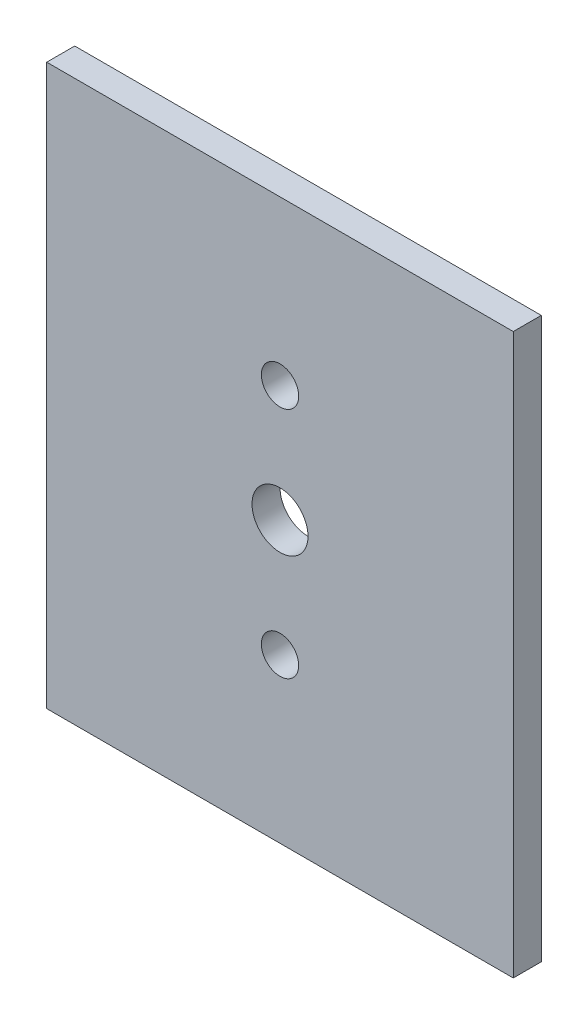
ISO-10303-21;
HEADER;
FILE_DESCRIPTION(('STEP AP214'),'2;1');
FILE_NAME('part.step','',(''),(''),'','','');
FILE_SCHEMA(('AUTOMOTIVE_DESIGN { 1 0 10303 214 1 1 1 1 }'));
ENDSEC;
DATA;
#1=APPLICATION_CONTEXT('core data for automotive mechanical design processes');
#2=APPLICATION_PROTOCOL_DEFINITION('international standard','automotive_design',2000,#1);
#3=PRODUCT_CONTEXT('',#1,'mechanical');
#4=PRODUCT('Part','Part','',(#3));
#5=PRODUCT_RELATED_PRODUCT_CATEGORY('part','',(#4));
#6=PRODUCT_DEFINITION_FORMATION('','',#4);
#7=PRODUCT_DEFINITION_CONTEXT('part definition',#1,'design');
#8=PRODUCT_DEFINITION('design','',#6,#7);
#9=PRODUCT_DEFINITION_SHAPE('','',#8);
#10=(LENGTH_UNIT() NAMED_UNIT(*) SI_UNIT(.MILLI.,.METRE.));
#11=(NAMED_UNIT(*) PLANE_ANGLE_UNIT() SI_UNIT($,.RADIAN.));
#12=(NAMED_UNIT(*) SI_UNIT($,.STERADIAN.) SOLID_ANGLE_UNIT());
#13=UNCERTAINTY_MEASURE_WITH_UNIT(LENGTH_MEASURE(1.E-05),#10,'distance_accuracy_value','');
#14=(GEOMETRIC_REPRESENTATION_CONTEXT(3) GLOBAL_UNCERTAINTY_ASSIGNED_CONTEXT((#13)) GLOBAL_UNIT_ASSIGNED_CONTEXT((#10,
#11,#12)) REPRESENTATION_CONTEXT('',''));
#15=CARTESIAN_POINT('',(0.,0.,0.));
#16=DIRECTION('',(0.,0.,1.));
#17=DIRECTION('',(1.,0.,0.));
#18=AXIS2_PLACEMENT_3D('',#15,#16,#17);
#19=CARTESIAN_POINT('',(0.,0.,3.));
#20=DIRECTION('',(0.,0.,-1.));
#21=DIRECTION('',(-1.,0.,0.));
#22=AXIS2_PLACEMENT_3D('',#19,#20,#21);
#23=PLANE('',#22);
#24=CARTESIAN_POINT('',(0.,12.5,3.));
#25=DIRECTION('',(0.,0.,-1.));
#26=DIRECTION('',(-1.,0.,0.));
#27=AXIS2_PLACEMENT_3D('',#24,#25,#26);
#28=CIRCLE('',#27,2.);
#29=CARTESIAN_POINT('',(-2.,12.5,3.));
#30=VERTEX_POINT('',#29);
#31=EDGE_CURVE('E134',#30,#30,#28,.T.);
#32=ORIENTED_EDGE('',*,*,#31,.T.);
#33=EDGE_LOOP('',(#32));
#34=FACE_BOUND('',#33,.T.);
#35=CARTESIAN_POINT('',(0.,-12.5,3.));
#36=DIRECTION('',(0.,0.,-1.));
#37=DIRECTION('',(-1.,0.,0.));
#38=AXIS2_PLACEMENT_3D('',#35,#36,#37);
#39=CIRCLE('',#38,2.);
#40=CARTESIAN_POINT('',(-1.99999999999992,-12.5,3.));
#41=VERTEX_POINT('',#40);
#42=EDGE_CURVE('E142',#41,#41,#39,.T.);
#43=ORIENTED_EDGE('',*,*,#42,.T.);
#44=EDGE_LOOP('',(#43));
#45=FACE_BOUND('',#44,.T.);
#46=DIRECTION('',(0.,1.,0.));
#47=VECTOR('',#46,1.);
#48=CARTESIAN_POINT('',(25.,-30.,3.));
#49=LINE('',#48,#47);
#50=CARTESIAN_POINT('',(25.,-30.,3.));
#51=VERTEX_POINT('',#50);
#52=CARTESIAN_POINT('',(25.,30.,3.));
#53=VERTEX_POINT('',#52);
#54=EDGE_CURVE('E92',#51,#53,#49,.T.);
#55=ORIENTED_EDGE('',*,*,#54,.T.);
#56=DIRECTION('',(-1.,0.,0.));
#57=VECTOR('',#56,1.);
#58=CARTESIAN_POINT('',(-25.,30.,3.));
#59=LINE('',#58,#57);
#60=CARTESIAN_POINT('',(-25.,30.,3.));
#61=VERTEX_POINT('',#60);
#62=EDGE_CURVE('E87',#53,#61,#59,.T.);
#63=ORIENTED_EDGE('',*,*,#62,.T.);
#64=DIRECTION('',(0.,-1.,0.));
#65=VECTOR('',#64,1.);
#66=CARTESIAN_POINT('',(-25.,-30.,3.));
#67=LINE('',#66,#65);
#68=CARTESIAN_POINT('',(-25.,-30.,3.));
#69=VERTEX_POINT('',#68);
#70=EDGE_CURVE('E90',#61,#69,#67,.T.);
#71=ORIENTED_EDGE('',*,*,#70,.T.);
#72=DIRECTION('',(1.,0.,0.));
#73=VECTOR('',#72,1.);
#74=CARTESIAN_POINT('',(-25.,-30.,3.));
#75=LINE('',#74,#73);
#76=EDGE_CURVE('E57',#69,#51,#75,.T.);
#77=ORIENTED_EDGE('',*,*,#76,.T.);
#78=EDGE_LOOP('',(#55,#63,#71,#77));
#79=FACE_BOUND('',#78,.T.);
#80=CARTESIAN_POINT('',(0.,0.,3.));
#81=DIRECTION('',(0.,0.,1.));
#82=DIRECTION('',(1.,0.,0.));
#83=AXIS2_PLACEMENT_3D('',#80,#81,#82);
#84=CIRCLE('',#83,3.);
#85=CARTESIAN_POINT('',(2.99999999999999,0.,3.));
#86=VERTEX_POINT('',#85);
#87=EDGE_CURVE('E112',#86,#86,#84,.T.);
#88=ORIENTED_EDGE('',*,*,#87,.F.);
#89=EDGE_LOOP('',(#88));
#90=FACE_BOUND('',#89,.T.);
#91=ADVANCED_FACE('F39',(#34,#45,#79,#90),#23,.F.);
#92=CARTESIAN_POINT('',(0.,0.,0.));
#93=DIRECTION('',(0.,0.,-1.));
#94=DIRECTION('',(-1.,0.,0.));
#95=AXIS2_PLACEMENT_3D('',#92,#93,#94);
#96=PLANE('',#95);
#97=CARTESIAN_POINT('',(0.,12.5,0.));
#98=DIRECTION('',(0.,0.,-1.));
#99=DIRECTION('',(-1.,0.,0.));
#100=AXIS2_PLACEMENT_3D('',#97,#98,#99);
#101=CIRCLE('',#100,2.);
#102=CARTESIAN_POINT('',(-2.,12.5,0.));
#103=VERTEX_POINT('',#102);
#104=EDGE_CURVE('E146',#103,#103,#101,.T.);
#105=ORIENTED_EDGE('',*,*,#104,.F.);
#106=EDGE_LOOP('',(#105));
#107=FACE_BOUND('',#106,.T.);
#108=CARTESIAN_POINT('',(0.,-12.5,0.));
#109=DIRECTION('',(0.,0.,-1.));
#110=DIRECTION('',(-1.,0.,0.));
#111=AXIS2_PLACEMENT_3D('',#108,#109,#110);
#112=CIRCLE('',#111,2.);
#113=CARTESIAN_POINT('',(-1.99999999999992,-12.5,0.));
#114=VERTEX_POINT('',#113);
#115=EDGE_CURVE('E138',#114,#114,#112,.T.);
#116=ORIENTED_EDGE('',*,*,#115,.F.);
#117=EDGE_LOOP('',(#116));
#118=FACE_BOUND('',#117,.T.);
#119=DIRECTION('',(0.,1.,0.));
#120=VECTOR('',#119,1.);
#121=CARTESIAN_POINT('',(25.,-30.,0.));
#122=LINE('',#121,#120);
#123=CARTESIAN_POINT('',(25.,-30.,0.));
#124=VERTEX_POINT('',#123);
#125=CARTESIAN_POINT('',(25.,30.,0.));
#126=VERTEX_POINT('',#125);
#127=EDGE_CURVE('E108',#124,#126,#122,.T.);
#128=ORIENTED_EDGE('',*,*,#127,.F.);
#129=DIRECTION('',(1.,0.,0.));
#130=VECTOR('',#129,1.);
#131=CARTESIAN_POINT('',(-25.,-30.,0.));
#132=LINE('',#131,#130);
#133=CARTESIAN_POINT('',(-25.,-30.,0.));
#134=VERTEX_POINT('',#133);
#135=EDGE_CURVE('E80',#134,#124,#132,.T.);
#136=ORIENTED_EDGE('',*,*,#135,.F.);
#137=DIRECTION('',(0.,-1.,0.));
#138=VECTOR('',#137,1.);
#139=CARTESIAN_POINT('',(-25.,-30.,0.));
#140=LINE('',#139,#138);
#141=CARTESIAN_POINT('',(-25.,30.,0.));
#142=VERTEX_POINT('',#141);
#143=EDGE_CURVE('E74',#142,#134,#140,.T.);
#144=ORIENTED_EDGE('',*,*,#143,.F.);
#145=DIRECTION('',(-1.,0.,0.));
#146=VECTOR('',#145,1.);
#147=CARTESIAN_POINT('',(-25.,30.,0.));
#148=LINE('',#147,#146);
#149=EDGE_CURVE('E97',#126,#142,#148,.T.);
#150=ORIENTED_EDGE('',*,*,#149,.F.);
#151=EDGE_LOOP('',(#128,#136,#144,#150));
#152=FACE_BOUND('',#151,.T.);
#153=CARTESIAN_POINT('',(0.,0.,0.));
#154=DIRECTION('',(0.,0.,1.));
#155=DIRECTION('',(1.,0.,0.));
#156=AXIS2_PLACEMENT_3D('',#153,#154,#155);
#157=CIRCLE('',#156,3.);
#158=CARTESIAN_POINT('',(2.99999999999999,0.,0.));
#159=VERTEX_POINT('',#158);
#160=EDGE_CURVE('E130',#159,#159,#157,.T.);
#161=ORIENTED_EDGE('',*,*,#160,.T.);
#162=EDGE_LOOP('',(#161));
#163=FACE_BOUND('',#162,.T.);
#164=ADVANCED_FACE('F125',(#107,#118,#152,#163),#96,.T.);
#165=CARTESIAN_POINT('',(25.,-30.,3.));
#166=DIRECTION('',(-1.,0.,0.));
#167=DIRECTION('',(0.,0.,1.));
#168=AXIS2_PLACEMENT_3D('',#165,#166,#167);
#169=PLANE('',#168);
#170=ORIENTED_EDGE('',*,*,#127,.T.);
#171=DIRECTION('',(0.,0.,-1.));
#172=VECTOR('',#171,1.);
#173=CARTESIAN_POINT('',(25.,30.,3.));
#174=LINE('',#173,#172);
#175=EDGE_CURVE('E11',#53,#126,#174,.T.);
#176=ORIENTED_EDGE('',*,*,#175,.F.);
#177=ORIENTED_EDGE('',*,*,#54,.F.);
#178=DIRECTION('',(0.,0.,-1.));
#179=VECTOR('',#178,1.);
#180=CARTESIAN_POINT('',(25.,-30.,3.));
#181=LINE('',#180,#179);
#182=EDGE_CURVE('E104',#51,#124,#181,.T.);
#183=ORIENTED_EDGE('',*,*,#182,.T.);
#184=EDGE_LOOP('',(#170,#176,#177,#183));
#185=FACE_BOUND('',#184,.T.);
#186=ADVANCED_FACE('F41',(#185),#169,.F.);
#187=CARTESIAN_POINT('',(-25.,30.,3.));
#188=DIRECTION('',(0.,-1.,0.));
#189=DIRECTION('',(0.,0.,-1.));
#190=AXIS2_PLACEMENT_3D('',#187,#188,#189);
#191=PLANE('',#190);
#192=ORIENTED_EDGE('',*,*,#149,.T.);
#193=DIRECTION('',(0.,0.,-1.));
#194=VECTOR('',#193,1.);
#195=CARTESIAN_POINT('',(-25.,30.,3.));
#196=LINE('',#195,#194);
#197=EDGE_CURVE('E49',#61,#142,#196,.T.);
#198=ORIENTED_EDGE('',*,*,#197,.F.);
#199=ORIENTED_EDGE('',*,*,#62,.F.);
#200=ORIENTED_EDGE('',*,*,#175,.T.);
#201=EDGE_LOOP('',(#192,#198,#199,#200));
#202=FACE_BOUND('',#201,.T.);
#203=ADVANCED_FACE('F96',(#202),#191,.F.);
#204=CARTESIAN_POINT('',(-25.,-30.,3.));
#205=DIRECTION('',(1.,0.,0.));
#206=DIRECTION('',(0.,0.,-1.));
#207=AXIS2_PLACEMENT_3D('',#204,#205,#206);
#208=PLANE('',#207);
#209=ORIENTED_EDGE('',*,*,#143,.T.);
#210=DIRECTION('',(0.,0.,-1.));
#211=VECTOR('',#210,1.);
#212=CARTESIAN_POINT('',(-25.,-30.,3.));
#213=LINE('',#212,#211);
#214=EDGE_CURVE('E99',#69,#134,#213,.T.);
#215=ORIENTED_EDGE('',*,*,#214,.F.);
#216=ORIENTED_EDGE('',*,*,#70,.F.);
#217=ORIENTED_EDGE('',*,*,#197,.T.);
#218=EDGE_LOOP('',(#209,#215,#216,#217));
#219=FACE_BOUND('',#218,.T.);
#220=ADVANCED_FACE('F100',(#219),#208,.F.);
#221=CARTESIAN_POINT('',(-25.,-30.,3.));
#222=DIRECTION('',(0.,1.,0.));
#223=DIRECTION('',(0.,0.,1.));
#224=AXIS2_PLACEMENT_3D('',#221,#222,#223);
#225=PLANE('',#224);
#226=ORIENTED_EDGE('',*,*,#135,.T.);
#227=ORIENTED_EDGE('',*,*,#182,.F.);
#228=ORIENTED_EDGE('',*,*,#76,.F.);
#229=ORIENTED_EDGE('',*,*,#214,.T.);
#230=EDGE_LOOP('',(#226,#227,#228,#229));
#231=FACE_BOUND('',#230,.T.);
#232=ADVANCED_FACE('F122',(#231),#225,.F.);
#233=CARTESIAN_POINT('',(0.,0.,3.));
#234=DIRECTION('',(0.,0.,-1.));
#235=DIRECTION('',(-1.,0.,0.));
#236=AXIS2_PLACEMENT_3D('',#233,#234,#235);
#237=CYLINDRICAL_SURFACE('',#236,3.);
#238=ORIENTED_EDGE('',*,*,#87,.T.);
#239=EDGE_LOOP('',(#238));
#240=FACE_BOUND('',#239,.T.);
#241=ORIENTED_EDGE('',*,*,#160,.F.);
#242=EDGE_LOOP('',(#241));
#243=FACE_BOUND('',#242,.T.);
#244=ADVANCED_FACE('F169',(#240,#243),#237,.F.);
#245=CARTESIAN_POINT('',(0.,-12.5,3.));
#246=DIRECTION('',(0.,0.,-1.));
#247=DIRECTION('',(-1.,0.,0.));
#248=AXIS2_PLACEMENT_3D('',#245,#246,#247);
#249=CYLINDRICAL_SURFACE('',#248,2.);
#250=ORIENTED_EDGE('',*,*,#42,.F.);
#251=EDGE_LOOP('',(#250));
#252=FACE_BOUND('',#251,.T.);
#253=ORIENTED_EDGE('',*,*,#115,.T.);
#254=EDGE_LOOP('',(#253));
#255=FACE_BOUND('',#254,.T.);
#256=ADVANCED_FACE('F159',(#252,#255),#249,.F.);
#257=CARTESIAN_POINT('',(0.,12.5,3.));
#258=DIRECTION('',(0.,0.,-1.));
#259=DIRECTION('',(-1.,0.,0.));
#260=AXIS2_PLACEMENT_3D('',#257,#258,#259);
#261=CYLINDRICAL_SURFACE('',#260,2.);
#262=ORIENTED_EDGE('',*,*,#31,.F.);
#263=EDGE_LOOP('',(#262));
#264=FACE_BOUND('',#263,.T.);
#265=ORIENTED_EDGE('',*,*,#104,.T.);
#266=EDGE_LOOP('',(#265));
#267=FACE_BOUND('',#266,.T.);
#268=ADVANCED_FACE('F156',(#264,#267),#261,.F.);
#269=CLOSED_SHELL('',(#91,#164,#186,#203,#220,#232,#244,#256,#268));
#270=MANIFOLD_SOLID_BREP('B2',#269);
#271=ADVANCED_BREP_SHAPE_REPRESENTATION('',(#18,#270),#14);
#272=SHAPE_DEFINITION_REPRESENTATION(#9,#271);
ENDSEC;
END-ISO-10303-21;
